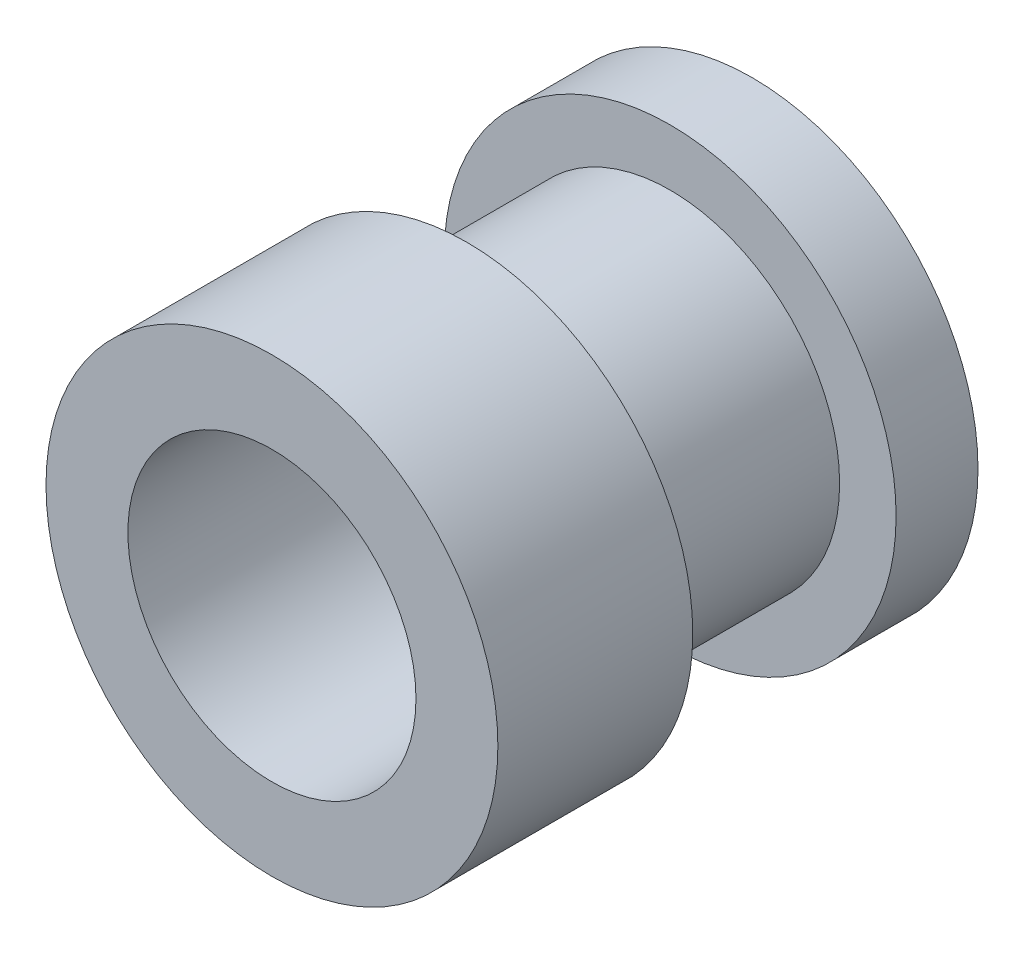
ISO-10303-21;
HEADER;
FILE_DESCRIPTION(('STEP AP214'),'2;1');
FILE_NAME('part.step','',(''),(''),'','','');
FILE_SCHEMA(('AUTOMOTIVE_DESIGN { 1 0 10303 214 1 1 1 1 }'));
ENDSEC;
DATA;
#1=APPLICATION_CONTEXT('core data for automotive mechanical design processes');
#2=APPLICATION_PROTOCOL_DEFINITION('international standard','automotive_design',2000,#1);
#3=PRODUCT_CONTEXT('',#1,'mechanical');
#4=PRODUCT('Part','Part','',(#3));
#5=PRODUCT_RELATED_PRODUCT_CATEGORY('part','',(#4));
#6=PRODUCT_DEFINITION_FORMATION('','',#4);
#7=PRODUCT_DEFINITION_CONTEXT('part definition',#1,'design');
#8=PRODUCT_DEFINITION('design','',#6,#7);
#9=PRODUCT_DEFINITION_SHAPE('','',#8);
#10=(LENGTH_UNIT() NAMED_UNIT(*) SI_UNIT(.MILLI.,.METRE.));
#11=(NAMED_UNIT(*) PLANE_ANGLE_UNIT() SI_UNIT($,.RADIAN.));
#12=(NAMED_UNIT(*) SI_UNIT($,.STERADIAN.) SOLID_ANGLE_UNIT());
#13=UNCERTAINTY_MEASURE_WITH_UNIT(LENGTH_MEASURE(1.E-05),#10,'distance_accuracy_value','');
#14=(GEOMETRIC_REPRESENTATION_CONTEXT(3) GLOBAL_UNCERTAINTY_ASSIGNED_CONTEXT((#13)) GLOBAL_UNIT_ASSIGNED_CONTEXT((#10,
#11,#12)) REPRESENTATION_CONTEXT('',''));
#15=CARTESIAN_POINT('',(0.,0.,0.));
#16=DIRECTION('',(0.,0.,1.));
#17=DIRECTION('',(1.,0.,0.));
#18=AXIS2_PLACEMENT_3D('',#15,#16,#17);
#19=CARTESIAN_POINT('',(0.,0.,10.795));
#20=DIRECTION('',(0.,0.,-1.));
#21=DIRECTION('',(-1.,0.,0.));
#22=AXIS2_PLACEMENT_3D('',#19,#20,#21);
#23=CYLINDRICAL_SURFACE('',#22,3.81);
#24=CARTESIAN_POINT('',(0.,0.,1.8415));
#25=DIRECTION('',(0.,0.,1.));
#26=DIRECTION('',(1.,0.,0.));
#27=AXIS2_PLACEMENT_3D('',#24,#25,#26);
#28=CIRCLE('',#27,3.81);
#29=CARTESIAN_POINT('',(3.81,0.,1.8415));
#30=VERTEX_POINT('',#29);
#31=EDGE_CURVE('E59',#30,#30,#28,.T.);
#32=ORIENTED_EDGE('',*,*,#31,.T.);
#33=EDGE_LOOP('',(#32));
#34=FACE_BOUND('',#33,.T.);
#35=CARTESIAN_POINT('',(0.,0.,6.4135));
#36=DIRECTION('',(0.,0.,1.));
#37=DIRECTION('',(1.,0.,0.));
#38=AXIS2_PLACEMENT_3D('',#35,#36,#37);
#39=CIRCLE('',#38,3.81);
#40=CARTESIAN_POINT('',(3.81,0.,6.4135));
#41=VERTEX_POINT('',#40);
#42=EDGE_CURVE('E10',#41,#41,#39,.T.);
#43=ORIENTED_EDGE('',*,*,#42,.F.);
#44=EDGE_LOOP('',(#43));
#45=FACE_BOUND('',#44,.T.);
#46=ADVANCED_FACE('F39',(#34,#45),#23,.T.);
#47=CARTESIAN_POINT('',(0.,0.,10.795));
#48=DIRECTION('',(0.,0.,1.));
#49=DIRECTION('',(1.,0.,0.));
#50=AXIS2_PLACEMENT_3D('',#47,#48,#49);
#51=PLANE('',#50);
#52=CARTESIAN_POINT('',(0.,0.,10.795));
#53=DIRECTION('',(0.,0.,1.));
#54=DIRECTION('',(1.,0.,0.));
#55=AXIS2_PLACEMENT_3D('',#52,#53,#54);
#56=CIRCLE('',#55,3.2385);
#57=CARTESIAN_POINT('',(3.2385,0.,10.795));
#58=VERTEX_POINT('',#57);
#59=EDGE_CURVE('E45',#58,#58,#56,.T.);
#60=ORIENTED_EDGE('',*,*,#59,.F.);
#61=EDGE_LOOP('',(#60));
#62=FACE_BOUND('',#61,.T.);
#63=CARTESIAN_POINT('',(0.,0.,10.795));
#64=DIRECTION('',(0.,0.,1.));
#65=DIRECTION('',(1.,0.,0.));
#66=AXIS2_PLACEMENT_3D('',#63,#64,#65);
#67=CIRCLE('',#66,5.08);
#68=CARTESIAN_POINT('',(5.08,0.,10.795));
#69=VERTEX_POINT('',#68);
#70=EDGE_CURVE('E62',#69,#69,#67,.T.);
#71=ORIENTED_EDGE('',*,*,#70,.T.);
#72=EDGE_LOOP('',(#71));
#73=FACE_BOUND('',#72,.T.);
#74=ADVANCED_FACE('F71',(#62,#73),#51,.T.);
#75=CARTESIAN_POINT('',(0.,0.,0.));
#76=DIRECTION('',(0.,0.,1.));
#77=DIRECTION('',(1.,0.,0.));
#78=AXIS2_PLACEMENT_3D('',#75,#76,#77);
#79=PLANE('',#78);
#80=CARTESIAN_POINT('',(0.,0.,0.));
#81=DIRECTION('',(0.,0.,1.));
#82=DIRECTION('',(1.,0.,0.));
#83=AXIS2_PLACEMENT_3D('',#80,#81,#82);
#84=CIRCLE('',#83,3.2385);
#85=CARTESIAN_POINT('',(3.2385,0.,0.));
#86=VERTEX_POINT('',#85);
#87=EDGE_CURVE('E49',#86,#86,#84,.T.);
#88=ORIENTED_EDGE('',*,*,#87,.T.);
#89=EDGE_LOOP('',(#88));
#90=FACE_BOUND('',#89,.T.);
#91=CARTESIAN_POINT('',(0.,0.,0.));
#92=DIRECTION('',(0.,0.,1.));
#93=DIRECTION('',(1.,0.,0.));
#94=AXIS2_PLACEMENT_3D('',#91,#92,#93);
#95=CIRCLE('',#94,5.08);
#96=CARTESIAN_POINT('',(5.08,0.,0.));
#97=VERTEX_POINT('',#96);
#98=EDGE_CURVE('E54',#97,#97,#95,.F.);
#99=ORIENTED_EDGE('',*,*,#98,.T.);
#100=EDGE_LOOP('',(#99));
#101=FACE_BOUND('',#100,.T.);
#102=ADVANCED_FACE('F93',(#90,#101),#79,.F.);
#103=CARTESIAN_POINT('',(0.,0.,10.795));
#104=DIRECTION('',(0.,0.,-1.));
#105=DIRECTION('',(-1.,0.,0.));
#106=AXIS2_PLACEMENT_3D('',#103,#104,#105);
#107=CYLINDRICAL_SURFACE('',#106,3.2385);
#108=ORIENTED_EDGE('',*,*,#59,.T.);
#109=EDGE_LOOP('',(#108));
#110=FACE_BOUND('',#109,.T.);
#111=ORIENTED_EDGE('',*,*,#87,.F.);
#112=EDGE_LOOP('',(#111));
#113=FACE_BOUND('',#112,.T.);
#114=ADVANCED_FACE('F102',(#110,#113),#107,.F.);
#115=CARTESIAN_POINT('',(0.,0.,-14.3684097937106));
#116=DIRECTION('',(0.,0.,1.));
#117=DIRECTION('',(1.,0.,0.));
#118=AXIS2_PLACEMENT_3D('',#115,#116,#117);
#119=CYLINDRICAL_SURFACE('',#118,5.08);
#120=ORIENTED_EDGE('',*,*,#98,.F.);
#121=EDGE_LOOP('',(#120));
#122=FACE_BOUND('',#121,.T.);
#123=CARTESIAN_POINT('',(0.,0.,1.8415));
#124=DIRECTION('',(0.,0.,1.));
#125=DIRECTION('',(1.,0.,0.));
#126=AXIS2_PLACEMENT_3D('',#123,#124,#125);
#127=CIRCLE('',#126,5.08);
#128=CARTESIAN_POINT('',(5.08,0.,1.8415));
#129=VERTEX_POINT('',#128);
#130=EDGE_CURVE('E56',#129,#129,#127,.T.);
#131=ORIENTED_EDGE('',*,*,#130,.F.);
#132=EDGE_LOOP('',(#131));
#133=FACE_BOUND('',#132,.T.);
#134=ADVANCED_FACE('F86',(#122,#133),#119,.T.);
#135=CARTESIAN_POINT('',(0.,0.,1.8415));
#136=DIRECTION('',(0.,0.,1.));
#137=DIRECTION('',(1.,0.,0.));
#138=AXIS2_PLACEMENT_3D('',#135,#136,#137);
#139=PLANE('',#138);
#140=ORIENTED_EDGE('',*,*,#31,.F.);
#141=EDGE_LOOP('',(#140));
#142=FACE_BOUND('',#141,.T.);
#143=ORIENTED_EDGE('',*,*,#130,.T.);
#144=EDGE_LOOP('',(#143));
#145=FACE_BOUND('',#144,.T.);
#146=ADVANCED_FACE('F76',(#142,#145),#139,.T.);
#147=CARTESIAN_POINT('',(0.,0.,25.1634097937106));
#148=DIRECTION('',(0.,0.,-1.));
#149=DIRECTION('',(-1.,0.,0.));
#150=AXIS2_PLACEMENT_3D('',#147,#148,#149);
#151=CYLINDRICAL_SURFACE('',#150,5.08);
#152=CARTESIAN_POINT('',(0.,0.,6.4135));
#153=DIRECTION('',(0.,0.,1.));
#154=DIRECTION('',(1.,0.,0.));
#155=AXIS2_PLACEMENT_3D('',#152,#153,#154);
#156=CIRCLE('',#155,5.08);
#157=CARTESIAN_POINT('',(5.08,0.,6.4135));
#158=VERTEX_POINT('',#157);
#159=EDGE_CURVE('E65',#158,#158,#156,.T.);
#160=ORIENTED_EDGE('',*,*,#159,.T.);
#161=EDGE_LOOP('',(#160));
#162=FACE_BOUND('',#161,.T.);
#163=ORIENTED_EDGE('',*,*,#70,.F.);
#164=EDGE_LOOP('',(#163));
#165=FACE_BOUND('',#164,.T.);
#166=ADVANCED_FACE('F73',(#162,#165),#151,.T.);
#167=CARTESIAN_POINT('',(0.,0.,6.4135));
#168=DIRECTION('',(0.,0.,1.));
#169=DIRECTION('',(1.,0.,0.));
#170=AXIS2_PLACEMENT_3D('',#167,#168,#169);
#171=PLANE('',#170);
#172=ORIENTED_EDGE('',*,*,#159,.F.);
#173=EDGE_LOOP('',(#172));
#174=FACE_BOUND('',#173,.T.);
#175=ORIENTED_EDGE('',*,*,#42,.T.);
#176=EDGE_LOOP('',(#175));
#177=FACE_BOUND('',#176,.T.);
#178=ADVANCED_FACE('F75',(#174,#177),#171,.F.);
#179=CLOSED_SHELL('',(#46,#74,#102,#114,#134,#146,#166,#178));
#180=MANIFOLD_SOLID_BREP('B2',#179);
#181=ADVANCED_BREP_SHAPE_REPRESENTATION('',(#18,#180),#14);
#182=SHAPE_DEFINITION_REPRESENTATION(#9,#181);
ENDSEC;
END-ISO-10303-21;
